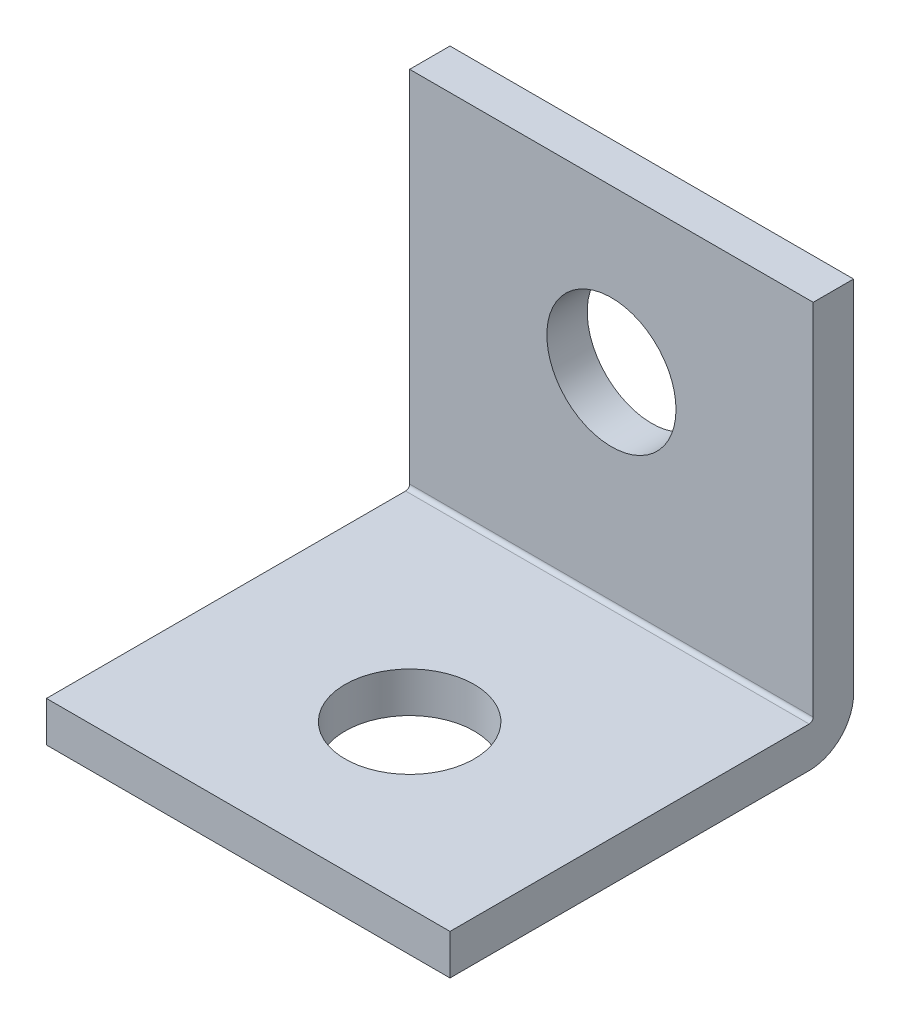
ISO-10303-21;
HEADER;
FILE_DESCRIPTION(('STEP AP214'),'2;1');
FILE_NAME('part.step','',(''),(''),'','','');
FILE_SCHEMA(('AUTOMOTIVE_DESIGN { 1 0 10303 214 1 1 1 1 }'));
ENDSEC;
DATA;
#1=APPLICATION_CONTEXT('core data for automotive mechanical design processes');
#2=APPLICATION_PROTOCOL_DEFINITION('international standard','automotive_design',2000,#1);
#3=PRODUCT_CONTEXT('',#1,'mechanical');
#4=PRODUCT('Part','Part','',(#3));
#5=PRODUCT_RELATED_PRODUCT_CATEGORY('part','',(#4));
#6=PRODUCT_DEFINITION_FORMATION('','',#4);
#7=PRODUCT_DEFINITION_CONTEXT('part definition',#1,'design');
#8=PRODUCT_DEFINITION('design','',#6,#7);
#9=PRODUCT_DEFINITION_SHAPE('','',#8);
#10=(LENGTH_UNIT() NAMED_UNIT(*) SI_UNIT(.MILLI.,.METRE.));
#11=(NAMED_UNIT(*) PLANE_ANGLE_UNIT() SI_UNIT($,.RADIAN.));
#12=(NAMED_UNIT(*) SI_UNIT($,.STERADIAN.) SOLID_ANGLE_UNIT());
#13=UNCERTAINTY_MEASURE_WITH_UNIT(LENGTH_MEASURE(1.E-05),#10,'distance_accuracy_value','');
#14=(GEOMETRIC_REPRESENTATION_CONTEXT(3) GLOBAL_UNCERTAINTY_ASSIGNED_CONTEXT((#13)) GLOBAL_UNIT_ASSIGNED_CONTEXT((#10,
#11,#12)) REPRESENTATION_CONTEXT('',''));
#15=CARTESIAN_POINT('',(0.,0.,0.));
#16=DIRECTION('',(0.,0.,1.));
#17=DIRECTION('',(1.,0.,0.));
#18=AXIS2_PLACEMENT_3D('',#15,#16,#17);
#19=CARTESIAN_POINT('',(0.,-5.,5.12588499176538));
#20=DIRECTION('',(0.,1.,0.));
#21=DIRECTION('',(0.,0.,1.));
#22=AXIS2_PLACEMENT_3D('',#19,#20,#21);
#23=PLANE('',#22);
#24=CARTESIAN_POINT('',(0.,-5.,6.));
#25=DIRECTION('',(0.,-1.,0.));
#26=DIRECTION('',(0.,0.,-1.));
#27=AXIS2_PLACEMENT_3D('',#24,#25,#26);
#28=CIRCLE('',#27,1.6);
#29=CARTESIAN_POINT('',(0.,-5.,4.4));
#30=VERTEX_POINT('',#29);
#31=EDGE_CURVE('E144',#30,#30,#28,.F.);
#32=ORIENTED_EDGE('',*,*,#31,.T.);
#33=EDGE_LOOP('',(#32));
#34=FACE_BOUND('',#33,.T.);
#35=DIRECTION('',(0.,0.,-1.));
#36=VECTOR('',#35,1.);
#37=CARTESIAN_POINT('',(5.,-5.,1.1));
#38=LINE('',#37,#36);
#39=CARTESIAN_POINT('',(4.99999999999999,-5.,10.));
#40=VERTEX_POINT('',#39);
#41=CARTESIAN_POINT('',(5.,-5.,1.1));
#42=VERTEX_POINT('',#41);
#43=EDGE_CURVE('E146',#40,#42,#38,.T.);
#44=ORIENTED_EDGE('',*,*,#43,.F.);
#45=DIRECTION('',(1.,0.,0.));
#46=VECTOR('',#45,1.);
#47=CARTESIAN_POINT('',(-5.,-5.,10.));
#48=LINE('',#47,#46);
#49=CARTESIAN_POINT('',(-5.,-5.,10.));
#50=VERTEX_POINT('',#49);
#51=EDGE_CURVE('E120',#50,#40,#48,.T.);
#52=ORIENTED_EDGE('',*,*,#51,.F.);
#53=DIRECTION('',(0.,0.,1.));
#54=VECTOR('',#53,1.);
#55=CARTESIAN_POINT('',(-5.,-5.,1.1));
#56=LINE('',#55,#54);
#57=CARTESIAN_POINT('',(-5.,-5.,1.1));
#58=VERTEX_POINT('',#57);
#59=EDGE_CURVE('E118',#58,#50,#56,.T.);
#60=ORIENTED_EDGE('',*,*,#59,.F.);
#61=DIRECTION('',(-1.,0.,0.));
#62=VECTOR('',#61,1.);
#63=CARTESIAN_POINT('',(0.,-5.,1.1));
#64=LINE('',#63,#62);
#65=EDGE_CURVE('E143',#42,#58,#64,.T.);
#66=ORIENTED_EDGE('',*,*,#65,.F.);
#67=EDGE_LOOP('',(#44,#52,#60,#66));
#68=FACE_BOUND('',#67,.T.);
#69=ADVANCED_FACE('F19',(#34,#68),#23,.F.);
#70=CARTESIAN_POINT('',(-5.,-4.,10.));
#71=DIRECTION('',(0.,0.,1.));
#72=DIRECTION('',(0.,-1.,0.));
#73=AXIS2_PLACEMENT_3D('',#70,#71,#72);
#74=PLANE('',#73);
#75=DIRECTION('',(1.,0.,0.));
#76=VECTOR('',#75,1.);
#77=CARTESIAN_POINT('',(0.,-4.,10.));
#78=LINE('',#77,#76);
#79=CARTESIAN_POINT('',(-5.,-4.,10.));
#80=VERTEX_POINT('',#79);
#81=CARTESIAN_POINT('',(4.99999999999999,-4.,10.));
#82=VERTEX_POINT('',#81);
#83=EDGE_CURVE('E99',#80,#82,#78,.T.);
#84=ORIENTED_EDGE('',*,*,#83,.F.);
#85=DIRECTION('',(0.,-1.,0.));
#86=VECTOR('',#85,1.);
#87=CARTESIAN_POINT('',(-5.,-4.,10.));
#88=LINE('',#87,#86);
#89=EDGE_CURVE('E95',#80,#50,#88,.T.);
#90=ORIENTED_EDGE('',*,*,#89,.T.);
#91=ORIENTED_EDGE('',*,*,#51,.T.);
#92=DIRECTION('',(0.,1.,0.));
#93=VECTOR('',#92,1.);
#94=CARTESIAN_POINT('',(4.99999999999999,-4.,10.));
#95=LINE('',#94,#93);
#96=EDGE_CURVE('E124',#82,#40,#95,.F.);
#97=ORIENTED_EDGE('',*,*,#96,.F.);
#98=EDGE_LOOP('',(#84,#90,#91,#97));
#99=FACE_BOUND('',#98,.T.);
#100=ADVANCED_FACE('F180',(#99),#74,.T.);
#101=CARTESIAN_POINT('',(0.,-4.,6.));
#102=DIRECTION('',(0.,-1.,0.));
#103=DIRECTION('',(0.,0.,-1.));
#104=AXIS2_PLACEMENT_3D('',#101,#102,#103);
#105=CYLINDRICAL_SURFACE('',#104,1.6);
#106=ORIENTED_EDGE('',*,*,#31,.F.);
#107=EDGE_LOOP('',(#106));
#108=FACE_BOUND('',#107,.T.);
#109=CARTESIAN_POINT('',(0.,-4.,6.));
#110=DIRECTION('',(0.,-1.,0.));
#111=DIRECTION('',(0.,0.,-1.));
#112=AXIS2_PLACEMENT_3D('',#109,#110,#111);
#113=CIRCLE('',#112,1.6);
#114=CARTESIAN_POINT('',(0.,-4.,4.4));
#115=VERTEX_POINT('',#114);
#116=EDGE_CURVE('E112',#115,#115,#113,.T.);
#117=ORIENTED_EDGE('',*,*,#116,.F.);
#118=EDGE_LOOP('',(#117));
#119=FACE_BOUND('',#118,.T.);
#120=ADVANCED_FACE('F226',(#108,#119),#105,.F.);
#121=CARTESIAN_POINT('',(0.,-3.9,1.1));
#122=DIRECTION('',(-1.,0.,0.));
#123=DIRECTION('',(0.,0.,1.));
#124=AXIS2_PLACEMENT_3D('',#121,#122,#123);
#125=CYLINDRICAL_SURFACE('',#124,1.1);
#126=DIRECTION('',(1.,0.,0.));
#127=VECTOR('',#126,1.);
#128=CARTESIAN_POINT('',(0.,-3.9,0.));
#129=LINE('',#128,#127);
#130=CARTESIAN_POINT('',(-5.,-3.9,0.));
#131=VERTEX_POINT('',#130);
#132=CARTESIAN_POINT('',(5.,-3.9,0.));
#133=VERTEX_POINT('',#132);
#134=EDGE_CURVE('E107',#131,#133,#129,.T.);
#135=ORIENTED_EDGE('',*,*,#134,.T.);
#136=CARTESIAN_POINT('',(5.,-3.9,1.1));
#137=DIRECTION('',(-1.,0.,0.));
#138=DIRECTION('',(0.,0.,1.));
#139=AXIS2_PLACEMENT_3D('',#136,#137,#138);
#140=CIRCLE('',#139,1.1);
#141=EDGE_CURVE('E100',#133,#42,#140,.T.);
#142=ORIENTED_EDGE('',*,*,#141,.T.);
#143=ORIENTED_EDGE('',*,*,#65,.T.);
#144=CARTESIAN_POINT('',(-5.,-3.9,1.1));
#145=DIRECTION('',(-1.,0.,0.));
#146=DIRECTION('',(0.,0.,1.));
#147=AXIS2_PLACEMENT_3D('',#144,#145,#146);
#148=CIRCLE('',#147,1.1);
#149=EDGE_CURVE('E141',#58,#131,#148,.F.);
#150=ORIENTED_EDGE('',*,*,#149,.T.);
#151=EDGE_LOOP('',(#135,#142,#143,#150));
#152=FACE_BOUND('',#151,.T.);
#153=ADVANCED_FACE('F185',(#152),#125,.T.);
#154=CARTESIAN_POINT('',(0.,-4.,5.12588499176538));
#155=DIRECTION('',(0.,1.,0.));
#156=DIRECTION('',(0.,0.,1.));
#157=AXIS2_PLACEMENT_3D('',#154,#155,#156);
#158=PLANE('',#157);
#159=ORIENTED_EDGE('',*,*,#116,.T.);
#160=EDGE_LOOP('',(#159));
#161=FACE_BOUND('',#160,.T.);
#162=ORIENTED_EDGE('',*,*,#83,.T.);
#163=DIRECTION('',(0.,0.,1.));
#164=VECTOR('',#163,1.);
#165=CARTESIAN_POINT('',(5.,-4.,5.12588499176538));
#166=LINE('',#165,#164);
#167=CARTESIAN_POINT('',(5.,-4.,1.1));
#168=VERTEX_POINT('',#167);
#169=EDGE_CURVE('E105',#82,#168,#166,.F.);
#170=ORIENTED_EDGE('',*,*,#169,.T.);
#171=DIRECTION('',(-1.,0.,0.));
#172=VECTOR('',#171,1.);
#173=CARTESIAN_POINT('',(0.,-4.,1.1));
#174=LINE('',#173,#172);
#175=CARTESIAN_POINT('',(-5.,-4.,1.1));
#176=VERTEX_POINT('',#175);
#177=EDGE_CURVE('E85',#168,#176,#174,.T.);
#178=ORIENTED_EDGE('',*,*,#177,.T.);
#179=DIRECTION('',(0.,0.,1.));
#180=VECTOR('',#179,1.);
#181=CARTESIAN_POINT('',(-5.,-4.,5.12588499176538));
#182=LINE('',#181,#180);
#183=EDGE_CURVE('E91',#176,#80,#182,.T.);
#184=ORIENTED_EDGE('',*,*,#183,.T.);
#185=EDGE_LOOP('',(#162,#170,#178,#184));
#186=FACE_BOUND('',#185,.T.);
#187=ADVANCED_FACE('F103',(#161,#186),#158,.T.);
#188=CARTESIAN_POINT('',(0.,0.,0.));
#189=DIRECTION('',(0.,0.,1.));
#190=DIRECTION('',(1.,0.,0.));
#191=AXIS2_PLACEMENT_3D('',#188,#189,#190);
#192=PLANE('',#191);
#193=CARTESIAN_POINT('',(0.,1.,0.));
#194=DIRECTION('',(0.,0.,1.));
#195=DIRECTION('',(1.,0.,0.));
#196=AXIS2_PLACEMENT_3D('',#193,#194,#195);
#197=CIRCLE('',#196,1.6);
#198=CARTESIAN_POINT('',(1.6,1.,0.));
#199=VERTEX_POINT('',#198);
#200=EDGE_CURVE('E132',#199,#199,#197,.T.);
#201=ORIENTED_EDGE('',*,*,#200,.T.);
#202=EDGE_LOOP('',(#201));
#203=FACE_BOUND('',#202,.T.);
#204=DIRECTION('',(0.,-1.,0.));
#205=VECTOR('',#204,1.);
#206=CARTESIAN_POINT('',(-5.,-5.,0.));
#207=LINE('',#206,#205);
#208=CARTESIAN_POINT('',(-5.,5.,0.));
#209=VERTEX_POINT('',#208);
#210=EDGE_CURVE('E137',#209,#131,#207,.T.);
#211=ORIENTED_EDGE('',*,*,#210,.F.);
#212=DIRECTION('',(1.,0.,0.));
#213=VECTOR('',#212,1.);
#214=CARTESIAN_POINT('',(-5.,5.,0.));
#215=LINE('',#214,#213);
#216=CARTESIAN_POINT('',(5.,5.,0.));
#217=VERTEX_POINT('',#216);
#218=EDGE_CURVE('E157',#217,#209,#215,.F.);
#219=ORIENTED_EDGE('',*,*,#218,.F.);
#220=DIRECTION('',(0.,1.,0.));
#221=VECTOR('',#220,1.);
#222=CARTESIAN_POINT('',(5.,5.,0.));
#223=LINE('',#222,#221);
#224=EDGE_CURVE('E106',#133,#217,#223,.T.);
#225=ORIENTED_EDGE('',*,*,#224,.F.);
#226=ORIENTED_EDGE('',*,*,#134,.F.);
#227=EDGE_LOOP('',(#211,#219,#225,#226));
#228=FACE_BOUND('',#227,.T.);
#229=ADVANCED_FACE('F190',(#203,#228),#192,.F.);
#230=CARTESIAN_POINT('',(0.,-3.9,1.1));
#231=DIRECTION('',(-1.,0.,0.));
#232=DIRECTION('',(0.,0.,1.));
#233=AXIS2_PLACEMENT_3D('',#230,#231,#232);
#234=CYLINDRICAL_SURFACE('',#233,0.1);
#235=CARTESIAN_POINT('',(5.,-3.9,1.1));
#236=DIRECTION('',(-1.,0.,0.));
#237=DIRECTION('',(0.,0.,1.));
#238=AXIS2_PLACEMENT_3D('',#235,#236,#237);
#239=CIRCLE('',#238,0.1);
#240=CARTESIAN_POINT('',(5.,-3.9,1.));
#241=VERTEX_POINT('',#240);
#242=EDGE_CURVE('E89',#241,#168,#239,.T.);
#243=ORIENTED_EDGE('',*,*,#242,.F.);
#244=DIRECTION('',(1.,0.,0.));
#245=VECTOR('',#244,1.);
#246=CARTESIAN_POINT('',(0.,-3.9,1.));
#247=LINE('',#246,#245);
#248=CARTESIAN_POINT('',(-5.,-3.9,1.));
#249=VERTEX_POINT('',#248);
#250=EDGE_CURVE('E87',#249,#241,#247,.T.);
#251=ORIENTED_EDGE('',*,*,#250,.F.);
#252=CARTESIAN_POINT('',(-5.,-3.9,1.1));
#253=DIRECTION('',(-1.,0.,0.));
#254=DIRECTION('',(0.,0.,1.));
#255=AXIS2_PLACEMENT_3D('',#252,#253,#254);
#256=CIRCLE('',#255,0.1);
#257=EDGE_CURVE('E22',#176,#249,#256,.F.);
#258=ORIENTED_EDGE('',*,*,#257,.F.);
#259=ORIENTED_EDGE('',*,*,#177,.F.);
#260=EDGE_LOOP('',(#243,#251,#258,#259));
#261=FACE_BOUND('',#260,.T.);
#262=ADVANCED_FACE('F83',(#261),#234,.F.);
#263=CARTESIAN_POINT('',(5.,5.,0.));
#264=DIRECTION('',(1.,0.,0.));
#265=DIRECTION('',(0.,1.,0.));
#266=AXIS2_PLACEMENT_3D('',#263,#264,#265);
#267=PLANE('',#266);
#268=DIRECTION('',(0.,0.,1.));
#269=VECTOR('',#268,1.);
#270=CARTESIAN_POINT('',(5.,5.,0.));
#271=LINE('',#270,#269);
#272=CARTESIAN_POINT('',(5.,5.,1.));
#273=VERTEX_POINT('',#272);
#274=EDGE_CURVE('E109',#273,#217,#271,.F.);
#275=ORIENTED_EDGE('',*,*,#274,.F.);
#276=DIRECTION('',(0.,1.,0.));
#277=VECTOR('',#276,1.);
#278=CARTESIAN_POINT('',(5.,0.,1.));
#279=LINE('',#278,#277);
#280=EDGE_CURVE('E127',#241,#273,#279,.T.);
#281=ORIENTED_EDGE('',*,*,#280,.F.);
#282=ORIENTED_EDGE('',*,*,#242,.T.);
#283=ORIENTED_EDGE('',*,*,#169,.F.);
#284=ORIENTED_EDGE('',*,*,#96,.T.);
#285=ORIENTED_EDGE('',*,*,#43,.T.);
#286=ORIENTED_EDGE('',*,*,#141,.F.);
#287=ORIENTED_EDGE('',*,*,#224,.T.);
#288=EDGE_LOOP('',(#275,#281,#282,#283,#284,#285,#286,#287));
#289=FACE_BOUND('',#288,.T.);
#290=ADVANCED_FACE('F149',(#289),#267,.T.);
#291=CARTESIAN_POINT('',(-5.,5.,0.));
#292=DIRECTION('',(0.,1.,0.));
#293=DIRECTION('',(0.,0.,1.));
#294=AXIS2_PLACEMENT_3D('',#291,#292,#293);
#295=PLANE('',#294);
#296=ORIENTED_EDGE('',*,*,#218,.T.);
#297=DIRECTION('',(0.,0.,1.));
#298=VECTOR('',#297,1.);
#299=CARTESIAN_POINT('',(-5.,5.,0.));
#300=LINE('',#299,#298);
#301=CARTESIAN_POINT('',(-5.,5.,1.));
#302=VERTEX_POINT('',#301);
#303=EDGE_CURVE('E37',#302,#209,#300,.F.);
#304=ORIENTED_EDGE('',*,*,#303,.F.);
#305=DIRECTION('',(1.,0.,0.));
#306=VECTOR('',#305,1.);
#307=CARTESIAN_POINT('',(0.,5.,1.));
#308=LINE('',#307,#306);
#309=EDGE_CURVE('E130',#273,#302,#308,.F.);
#310=ORIENTED_EDGE('',*,*,#309,.F.);
#311=ORIENTED_EDGE('',*,*,#274,.T.);
#312=EDGE_LOOP('',(#296,#304,#310,#311));
#313=FACE_BOUND('',#312,.T.);
#314=ADVANCED_FACE('F191',(#313),#295,.T.);
#315=CARTESIAN_POINT('',(-5.,-5.,0.));
#316=DIRECTION('',(-1.,0.,0.));
#317=DIRECTION('',(0.,-1.,0.));
#318=AXIS2_PLACEMENT_3D('',#315,#316,#317);
#319=PLANE('',#318);
#320=ORIENTED_EDGE('',*,*,#303,.T.);
#321=ORIENTED_EDGE('',*,*,#210,.T.);
#322=ORIENTED_EDGE('',*,*,#149,.F.);
#323=ORIENTED_EDGE('',*,*,#59,.T.);
#324=ORIENTED_EDGE('',*,*,#89,.F.);
#325=ORIENTED_EDGE('',*,*,#183,.F.);
#326=ORIENTED_EDGE('',*,*,#257,.T.);
#327=DIRECTION('',(0.,1.,0.));
#328=VECTOR('',#327,1.);
#329=CARTESIAN_POINT('',(-5.,0.,1.));
#330=LINE('',#329,#328);
#331=EDGE_CURVE('E28',#302,#249,#330,.F.);
#332=ORIENTED_EDGE('',*,*,#331,.F.);
#333=EDGE_LOOP('',(#320,#321,#322,#323,#324,#325,#326,#332));
#334=FACE_BOUND('',#333,.T.);
#335=ADVANCED_FACE('F92',(#334),#319,.T.);
#336=CARTESIAN_POINT('',(0.,1.,0.));
#337=DIRECTION('',(0.,0.,1.));
#338=DIRECTION('',(1.,0.,0.));
#339=AXIS2_PLACEMENT_3D('',#336,#337,#338);
#340=CYLINDRICAL_SURFACE('',#339,1.6);
#341=CARTESIAN_POINT('',(0.,1.,1.));
#342=DIRECTION('',(0.,0.,1.));
#343=DIRECTION('',(1.,0.,0.));
#344=AXIS2_PLACEMENT_3D('',#341,#342,#343);
#345=CIRCLE('',#344,1.6);
#346=CARTESIAN_POINT('',(1.6,1.,1.));
#347=VERTEX_POINT('',#346);
#348=EDGE_CURVE('E11',#347,#347,#345,.F.);
#349=ORIENTED_EDGE('',*,*,#348,.F.);
#350=EDGE_LOOP('',(#349));
#351=FACE_BOUND('',#350,.T.);
#352=ORIENTED_EDGE('',*,*,#200,.F.);
#353=EDGE_LOOP('',(#352));
#354=FACE_BOUND('',#353,.T.);
#355=ADVANCED_FACE('F199',(#351,#354),#340,.F.);
#356=CARTESIAN_POINT('',(0.,0.,1.));
#357=DIRECTION('',(0.,0.,1.));
#358=DIRECTION('',(1.,0.,0.));
#359=AXIS2_PLACEMENT_3D('',#356,#357,#358);
#360=PLANE('',#359);
#361=ORIENTED_EDGE('',*,*,#348,.T.);
#362=EDGE_LOOP('',(#361));
#363=FACE_BOUND('',#362,.T.);
#364=ORIENTED_EDGE('',*,*,#309,.T.);
#365=ORIENTED_EDGE('',*,*,#331,.T.);
#366=ORIENTED_EDGE('',*,*,#250,.T.);
#367=ORIENTED_EDGE('',*,*,#280,.T.);
#368=EDGE_LOOP('',(#364,#365,#366,#367));
#369=FACE_BOUND('',#368,.T.);
#370=ADVANCED_FACE('F153',(#363,#369),#360,.T.);
#371=CLOSED_SHELL('',(#69,#100,#120,#153,#187,#229,#262,#290,#314,#335,#355,#370));
#372=MANIFOLD_SOLID_BREP('B1',#371);
#373=ADVANCED_BREP_SHAPE_REPRESENTATION('',(#18,#372),#14);
#374=SHAPE_DEFINITION_REPRESENTATION(#9,#373);
ENDSEC;
END-ISO-10303-21;
